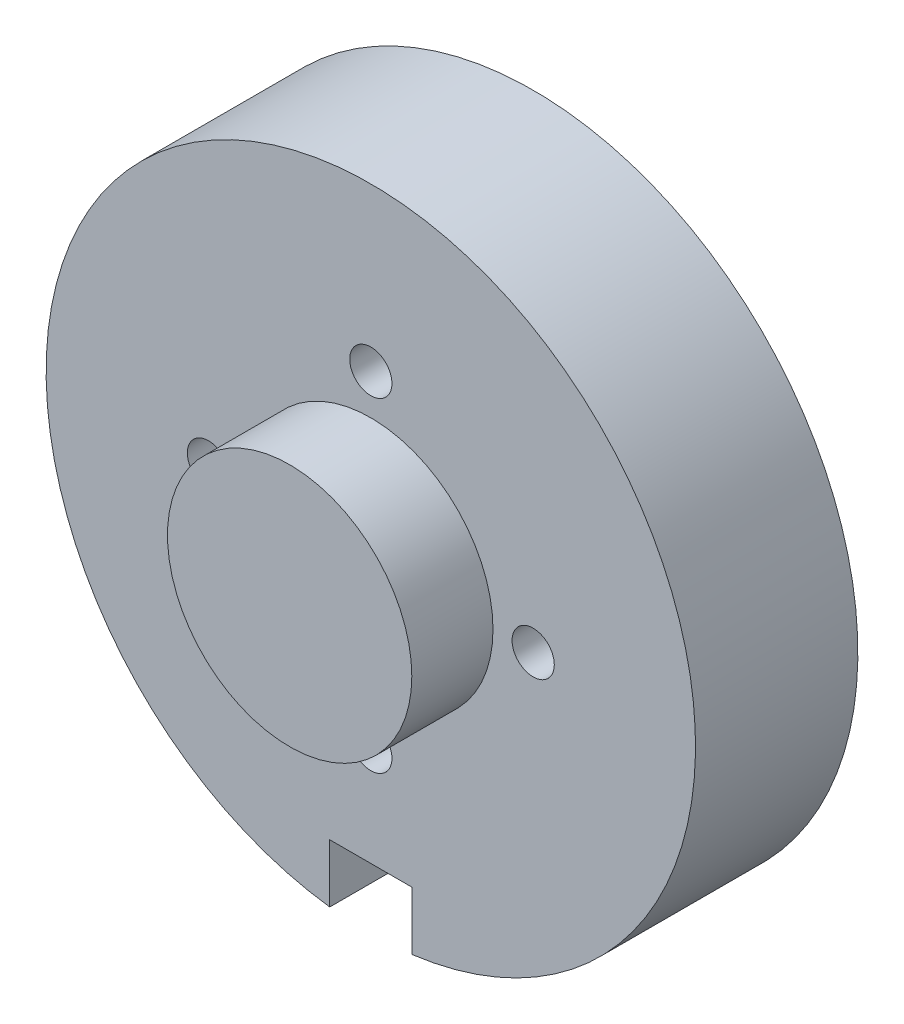
ISO-10303-21;
HEADER;
FILE_DESCRIPTION(('STEP AP214'),'2;1');
FILE_NAME('part.step','',(''),(''),'','','');
FILE_SCHEMA(('AUTOMOTIVE_DESIGN { 1 0 10303 214 1 1 1 1 }'));
ENDSEC;
DATA;
#1=APPLICATION_CONTEXT('core data for automotive mechanical design processes');
#2=APPLICATION_PROTOCOL_DEFINITION('international standard','automotive_design',2000,#1);
#3=PRODUCT_CONTEXT('',#1,'mechanical');
#4=PRODUCT('Part','Part','',(#3));
#5=PRODUCT_RELATED_PRODUCT_CATEGORY('part','',(#4));
#6=PRODUCT_DEFINITION_FORMATION('','',#4);
#7=PRODUCT_DEFINITION_CONTEXT('part definition',#1,'design');
#8=PRODUCT_DEFINITION('design','',#6,#7);
#9=PRODUCT_DEFINITION_SHAPE('','',#8);
#10=(LENGTH_UNIT() NAMED_UNIT(*) SI_UNIT(.MILLI.,.METRE.));
#11=(NAMED_UNIT(*) PLANE_ANGLE_UNIT() SI_UNIT($,.RADIAN.));
#12=(NAMED_UNIT(*) SI_UNIT($,.STERADIAN.) SOLID_ANGLE_UNIT());
#13=UNCERTAINTY_MEASURE_WITH_UNIT(LENGTH_MEASURE(1.E-05),#10,'distance_accuracy_value','');
#14=(GEOMETRIC_REPRESENTATION_CONTEXT(3) GLOBAL_UNCERTAINTY_ASSIGNED_CONTEXT((#13)) GLOBAL_UNIT_ASSIGNED_CONTEXT((#10,
#11,#12)) REPRESENTATION_CONTEXT('',''));
#15=CARTESIAN_POINT('',(0.,0.,0.));
#16=DIRECTION('',(0.,0.,1.));
#17=DIRECTION('',(1.,0.,0.));
#18=AXIS2_PLACEMENT_3D('',#15,#16,#17);
#19=CARTESIAN_POINT('',(6.42620000000001,0.,-25.4));
#20=DIRECTION('',(-1.,0.,0.));
#21=DIRECTION('',(0.,-1.,0.));
#22=AXIS2_PLACEMENT_3D('',#19,#20,#21);
#23=PLANE('',#22);
#24=DIRECTION('',(0.,-1.,0.));
#25=VECTOR('',#24,1.);
#26=CARTESIAN_POINT('',(6.42620000000001,0.,0.));
#27=LINE('',#26,#25);
#28=CARTESIAN_POINT('',(6.4262,-41.275,0.));
#29=VERTEX_POINT('',#28);
#30=CARTESIAN_POINT('',(6.4262,-50.3919036508842,0.));
#31=VERTEX_POINT('',#30);
#32=EDGE_CURVE('E128',#29,#31,#27,.T.);
#33=ORIENTED_EDGE('',*,*,#32,.F.);
#34=DIRECTION('',(0.,0.,1.));
#35=VECTOR('',#34,1.);
#36=CARTESIAN_POINT('',(6.4262,-41.275,-25.4));
#37=LINE('',#36,#35);
#38=CARTESIAN_POINT('',(6.4262,-41.275,-25.4));
#39=VERTEX_POINT('',#38);
#40=EDGE_CURVE('E11',#39,#29,#37,.T.);
#41=ORIENTED_EDGE('',*,*,#40,.F.);
#42=DIRECTION('',(0.,-1.,0.));
#43=VECTOR('',#42,1.);
#44=CARTESIAN_POINT('',(6.42620000000001,0.,-25.4));
#45=LINE('',#44,#43);
#46=CARTESIAN_POINT('',(6.4262,-50.3919036508842,-25.4));
#47=VERTEX_POINT('',#46);
#48=EDGE_CURVE('E102',#39,#47,#45,.T.);
#49=ORIENTED_EDGE('',*,*,#48,.T.);
#50=DIRECTION('',(0.,0.,1.));
#51=VECTOR('',#50,1.);
#52=CARTESIAN_POINT('',(6.4262,-50.3919036508842,-25.4));
#53=LINE('',#52,#51);
#54=EDGE_CURVE('E43',#47,#31,#53,.T.);
#55=ORIENTED_EDGE('',*,*,#54,.T.);
#56=EDGE_LOOP('',(#33,#41,#49,#55));
#57=FACE_BOUND('',#56,.T.);
#58=ADVANCED_FACE('F39',(#57),#23,.T.);
#59=CARTESIAN_POINT('',(0.,-41.275,-25.4));
#60=DIRECTION('',(0.,-1.,0.));
#61=DIRECTION('',(0.,0.,-1.));
#62=AXIS2_PLACEMENT_3D('',#59,#60,#61);
#63=PLANE('',#62);
#64=DIRECTION('',(1.,0.,0.));
#65=VECTOR('',#64,1.);
#66=CARTESIAN_POINT('',(0.,-41.275,0.));
#67=LINE('',#66,#65);
#68=CARTESIAN_POINT('',(-6.4262,-41.275,0.));
#69=VERTEX_POINT('',#68);
#70=EDGE_CURVE('E137',#69,#29,#67,.T.);
#71=ORIENTED_EDGE('',*,*,#70,.F.);
#72=DIRECTION('',(0.,0.,1.));
#73=VECTOR('',#72,1.);
#74=CARTESIAN_POINT('',(-6.4262,-41.275,-25.4));
#75=LINE('',#74,#73);
#76=CARTESIAN_POINT('',(-6.4262,-41.275,-25.4));
#77=VERTEX_POINT('',#76);
#78=EDGE_CURVE('E50',#77,#69,#75,.T.);
#79=ORIENTED_EDGE('',*,*,#78,.F.);
#80=DIRECTION('',(1.,0.,0.));
#81=VECTOR('',#80,1.);
#82=CARTESIAN_POINT('',(0.,-41.275,-25.4));
#83=LINE('',#82,#81);
#84=EDGE_CURVE('E92',#77,#39,#83,.T.);
#85=ORIENTED_EDGE('',*,*,#84,.T.);
#86=ORIENTED_EDGE('',*,*,#40,.T.);
#87=EDGE_LOOP('',(#71,#79,#85,#86));
#88=FACE_BOUND('',#87,.T.);
#89=ADVANCED_FACE('F146',(#88),#63,.T.);
#90=CARTESIAN_POINT('',(-6.42620000000001,0.,-25.4));
#91=DIRECTION('',(-1.,0.,0.));
#92=DIRECTION('',(0.,-1.,0.));
#93=AXIS2_PLACEMENT_3D('',#90,#91,#92);
#94=PLANE('',#93);
#95=DIRECTION('',(0.,-1.,0.));
#96=VECTOR('',#95,1.);
#97=CARTESIAN_POINT('',(-6.42620000000001,0.,0.));
#98=LINE('',#97,#96);
#99=CARTESIAN_POINT('',(-6.4262,-50.3919036508842,0.));
#100=VERTEX_POINT('',#99);
#101=EDGE_CURVE('E97',#69,#100,#98,.T.);
#102=ORIENTED_EDGE('',*,*,#101,.T.);
#103=DIRECTION('',(0.,0.,1.));
#104=VECTOR('',#103,1.);
#105=CARTESIAN_POINT('',(-6.4262,-50.3919036508842,-25.4));
#106=LINE('',#105,#104);
#107=CARTESIAN_POINT('',(-6.4262,-50.3919036508842,-25.4));
#108=VERTEX_POINT('',#107);
#109=EDGE_CURVE('E95',#108,#100,#106,.T.);
#110=ORIENTED_EDGE('',*,*,#109,.F.);
#111=DIRECTION('',(0.,-1.,0.));
#112=VECTOR('',#111,1.);
#113=CARTESIAN_POINT('',(-6.42620000000001,0.,-25.4));
#114=LINE('',#113,#112);
#115=EDGE_CURVE('E88',#77,#108,#114,.T.);
#116=ORIENTED_EDGE('',*,*,#115,.F.);
#117=ORIENTED_EDGE('',*,*,#78,.T.);
#118=EDGE_LOOP('',(#102,#110,#116,#117));
#119=FACE_BOUND('',#118,.T.);
#120=ADVANCED_FACE('F96',(#119),#94,.F.);
#121=CARTESIAN_POINT('',(0.,25.4,-25.4));
#122=DIRECTION('',(0.,0.,1.));
#123=DIRECTION('',(1.,0.,0.));
#124=AXIS2_PLACEMENT_3D('',#121,#122,#123);
#125=CYLINDRICAL_SURFACE('',#124,3.302);
#126=CARTESIAN_POINT('',(0.,25.4,-25.4));
#127=DIRECTION('',(0.,0.,1.));
#128=DIRECTION('',(1.,0.,0.));
#129=AXIS2_PLACEMENT_3D('',#126,#127,#128);
#130=CIRCLE('',#129,3.302);
#131=CARTESIAN_POINT('',(3.302,25.4,-25.4));
#132=VERTEX_POINT('',#131);
#133=EDGE_CURVE('E105',#132,#132,#130,.T.);
#134=ORIENTED_EDGE('',*,*,#133,.F.);
#135=EDGE_LOOP('',(#134));
#136=FACE_BOUND('',#135,.T.);
#137=CARTESIAN_POINT('',(0.,25.4,0.));
#138=DIRECTION('',(0.,0.,1.));
#139=DIRECTION('',(1.,0.,0.));
#140=AXIS2_PLACEMENT_3D('',#137,#138,#139);
#141=CIRCLE('',#140,3.302);
#142=CARTESIAN_POINT('',(3.302,25.4,0.));
#143=VERTEX_POINT('',#142);
#144=EDGE_CURVE('E124',#143,#143,#141,.T.);
#145=ORIENTED_EDGE('',*,*,#144,.T.);
#146=EDGE_LOOP('',(#145));
#147=FACE_BOUND('',#146,.T.);
#148=ADVANCED_FACE('F153',(#136,#147),#125,.F.);
#149=CARTESIAN_POINT('',(25.4,0.,-25.4));
#150=DIRECTION('',(0.,0.,1.));
#151=DIRECTION('',(1.,0.,0.));
#152=AXIS2_PLACEMENT_3D('',#149,#150,#151);
#153=CYLINDRICAL_SURFACE('',#152,3.302);
#154=CARTESIAN_POINT('',(25.4,0.,-25.4));
#155=DIRECTION('',(0.,0.,1.));
#156=DIRECTION('',(1.,0.,0.));
#157=AXIS2_PLACEMENT_3D('',#154,#155,#156);
#158=CIRCLE('',#157,3.302);
#159=CARTESIAN_POINT('',(28.702,0.,-25.4));
#160=VERTEX_POINT('',#159);
#161=EDGE_CURVE('E215',#160,#160,#158,.T.);
#162=ORIENTED_EDGE('',*,*,#161,.F.);
#163=EDGE_LOOP('',(#162));
#164=FACE_BOUND('',#163,.T.);
#165=CARTESIAN_POINT('',(25.4,0.,0.));
#166=DIRECTION('',(0.,0.,1.));
#167=DIRECTION('',(1.,0.,0.));
#168=AXIS2_PLACEMENT_3D('',#165,#166,#167);
#169=CIRCLE('',#168,3.302);
#170=CARTESIAN_POINT('',(28.702,0.,0.));
#171=VERTEX_POINT('',#170);
#172=EDGE_CURVE('E120',#171,#171,#169,.T.);
#173=ORIENTED_EDGE('',*,*,#172,.T.);
#174=EDGE_LOOP('',(#173));
#175=FACE_BOUND('',#174,.T.);
#176=ADVANCED_FACE('F163',(#164,#175),#153,.F.);
#177=CARTESIAN_POINT('',(0.,-25.4,-25.4));
#178=DIRECTION('',(0.,0.,1.));
#179=DIRECTION('',(1.,0.,0.));
#180=AXIS2_PLACEMENT_3D('',#177,#178,#179);
#181=CYLINDRICAL_SURFACE('',#180,3.30200000000137);
#182=CARTESIAN_POINT('',(0.,-25.4,-25.4));
#183=DIRECTION('',(0.,0.,1.));
#184=DIRECTION('',(1.,0.,0.));
#185=AXIS2_PLACEMENT_3D('',#182,#183,#184);
#186=CIRCLE('',#185,3.30200000000137);
#187=CARTESIAN_POINT('',(3.30200000000138,-25.4,-25.4));
#188=VERTEX_POINT('',#187);
#189=EDGE_CURVE('E177',#188,#188,#186,.T.);
#190=ORIENTED_EDGE('',*,*,#189,.F.);
#191=EDGE_LOOP('',(#190));
#192=FACE_BOUND('',#191,.T.);
#193=CARTESIAN_POINT('',(0.,-25.4,0.));
#194=DIRECTION('',(0.,0.,1.));
#195=DIRECTION('',(1.,0.,0.));
#196=AXIS2_PLACEMENT_3D('',#193,#194,#195);
#197=CIRCLE('',#196,3.30200000000137);
#198=CARTESIAN_POINT('',(3.30200000000138,-25.4,0.));
#199=VERTEX_POINT('',#198);
#200=EDGE_CURVE('E115',#199,#199,#197,.T.);
#201=ORIENTED_EDGE('',*,*,#200,.T.);
#202=EDGE_LOOP('',(#201));
#203=FACE_BOUND('',#202,.T.);
#204=ADVANCED_FACE('F166',(#192,#203),#181,.F.);
#205=CARTESIAN_POINT('',(-25.3999999999993,-7.20343923399369E-13,-25.4));
#206=DIRECTION('',(0.,0.,1.));
#207=DIRECTION('',(1.,0.,0.));
#208=AXIS2_PLACEMENT_3D('',#205,#206,#207);
#209=CYLINDRICAL_SURFACE('',#208,3.302);
#210=CARTESIAN_POINT('',(-25.3999999999993,-7.20343923399369E-13,-25.4));
#211=DIRECTION('',(0.,0.,1.));
#212=DIRECTION('',(1.,0.,0.));
#213=AXIS2_PLACEMENT_3D('',#210,#211,#212);
#214=CIRCLE('',#213,3.302);
#215=CARTESIAN_POINT('',(-22.0979999999993,-7.20343923399369E-13,-25.4));
#216=VERTEX_POINT('',#215);
#217=EDGE_CURVE('E140',#216,#216,#214,.T.);
#218=ORIENTED_EDGE('',*,*,#217,.F.);
#219=EDGE_LOOP('',(#218));
#220=FACE_BOUND('',#219,.T.);
#221=CARTESIAN_POINT('',(-25.3999999999993,-7.20343923399369E-13,0.));
#222=DIRECTION('',(0.,0.,1.));
#223=DIRECTION('',(1.,0.,0.));
#224=AXIS2_PLACEMENT_3D('',#221,#222,#223);
#225=CIRCLE('',#224,3.302);
#226=CARTESIAN_POINT('',(-22.0979999999993,-7.20343923399369E-13,0.));
#227=VERTEX_POINT('',#226);
#228=EDGE_CURVE('E111',#227,#227,#225,.T.);
#229=ORIENTED_EDGE('',*,*,#228,.T.);
#230=EDGE_LOOP('',(#229));
#231=FACE_BOUND('',#230,.T.);
#232=ADVANCED_FACE('F41',(#220,#231),#209,.F.);
#233=CARTESIAN_POINT('',(0.,0.,-25.4));
#234=DIRECTION('',(0.,0.,1.));
#235=DIRECTION('',(1.,0.,0.));
#236=AXIS2_PLACEMENT_3D('',#233,#234,#235);
#237=CYLINDRICAL_SURFACE('',#236,50.8);
#238=CARTESIAN_POINT('',(0.,0.,0.));
#239=DIRECTION('',(0.,0.,1.));
#240=DIRECTION('',(1.,0.,0.));
#241=AXIS2_PLACEMENT_3D('',#238,#239,#240);
#242=CIRCLE('',#241,50.8);
#243=EDGE_CURVE('E132',#31,#100,#242,.T.);
#244=ORIENTED_EDGE('',*,*,#243,.F.);
#245=ORIENTED_EDGE('',*,*,#54,.F.);
#246=CARTESIAN_POINT('',(0.,0.,-25.4));
#247=DIRECTION('',(0.,0.,1.));
#248=DIRECTION('',(1.,0.,0.));
#249=AXIS2_PLACEMENT_3D('',#246,#247,#248);
#250=CIRCLE('',#249,50.8);
#251=EDGE_CURVE('E91',#47,#108,#250,.T.);
#252=ORIENTED_EDGE('',*,*,#251,.T.);
#253=ORIENTED_EDGE('',*,*,#109,.T.);
#254=EDGE_LOOP('',(#244,#245,#252,#253));
#255=FACE_BOUND('',#254,.T.);
#256=ADVANCED_FACE('F100',(#255),#237,.T.);
#257=CARTESIAN_POINT('',(0.,0.,-25.4));
#258=DIRECTION('',(0.,0.,1.));
#259=DIRECTION('',(1.,0.,0.));
#260=AXIS2_PLACEMENT_3D('',#257,#258,#259);
#261=PLANE('',#260);
#262=ORIENTED_EDGE('',*,*,#217,.T.);
#263=EDGE_LOOP('',(#262));
#264=FACE_BOUND('',#263,.T.);
#265=ORIENTED_EDGE('',*,*,#189,.T.);
#266=EDGE_LOOP('',(#265));
#267=FACE_BOUND('',#266,.T.);
#268=ORIENTED_EDGE('',*,*,#161,.T.);
#269=EDGE_LOOP('',(#268));
#270=FACE_BOUND('',#269,.T.);
#271=ORIENTED_EDGE('',*,*,#133,.T.);
#272=EDGE_LOOP('',(#271));
#273=FACE_BOUND('',#272,.T.);
#274=ORIENTED_EDGE('',*,*,#48,.F.);
#275=ORIENTED_EDGE('',*,*,#84,.F.);
#276=ORIENTED_EDGE('',*,*,#115,.T.);
#277=ORIENTED_EDGE('',*,*,#251,.F.);
#278=EDGE_LOOP('',(#274,#275,#276,#277));
#279=FACE_BOUND('',#278,.T.);
#280=ADVANCED_FACE('F90',(#264,#267,#270,#273,#279),#261,.F.);
#281=CARTESIAN_POINT('',(0.,0.,0.));
#282=DIRECTION('',(0.,0.,1.));
#283=DIRECTION('',(1.,0.,0.));
#284=AXIS2_PLACEMENT_3D('',#281,#282,#283);
#285=PLANE('',#284);
#286=CARTESIAN_POINT('',(0.,0.,0.));
#287=DIRECTION('',(0.,0.,1.));
#288=DIRECTION('',(1.,0.,0.));
#289=AXIS2_PLACEMENT_3D('',#286,#287,#288);
#290=CIRCLE('',#289,19.1135);
#291=CARTESIAN_POINT('',(19.1135,0.,0.));
#292=VERTEX_POINT('',#291);
#293=EDGE_CURVE('E200',#292,#292,#290,.T.);
#294=ORIENTED_EDGE('',*,*,#293,.F.);
#295=EDGE_LOOP('',(#294));
#296=FACE_BOUND('',#295,.T.);
#297=ORIENTED_EDGE('',*,*,#228,.F.);
#298=EDGE_LOOP('',(#297));
#299=FACE_BOUND('',#298,.T.);
#300=ORIENTED_EDGE('',*,*,#200,.F.);
#301=EDGE_LOOP('',(#300));
#302=FACE_BOUND('',#301,.T.);
#303=ORIENTED_EDGE('',*,*,#172,.F.);
#304=EDGE_LOOP('',(#303));
#305=FACE_BOUND('',#304,.T.);
#306=ORIENTED_EDGE('',*,*,#144,.F.);
#307=EDGE_LOOP('',(#306));
#308=FACE_BOUND('',#307,.T.);
#309=ORIENTED_EDGE('',*,*,#32,.T.);
#310=ORIENTED_EDGE('',*,*,#243,.T.);
#311=ORIENTED_EDGE('',*,*,#101,.F.);
#312=ORIENTED_EDGE('',*,*,#70,.T.);
#313=EDGE_LOOP('',(#309,#310,#311,#312));
#314=FACE_BOUND('',#313,.T.);
#315=ADVANCED_FACE('F145',(#296,#299,#302,#305,#308,#314),#285,.T.);
#316=CARTESIAN_POINT('',(0.,0.,12.7));
#317=DIRECTION('',(0.,0.,-1.));
#318=DIRECTION('',(-1.,0.,0.));
#319=AXIS2_PLACEMENT_3D('',#316,#317,#318);
#320=CYLINDRICAL_SURFACE('',#319,19.1135);
#321=CARTESIAN_POINT('',(0.,0.,12.7));
#322=DIRECTION('',(0.,0.,1.));
#323=DIRECTION('',(1.,0.,0.));
#324=AXIS2_PLACEMENT_3D('',#321,#322,#323);
#325=CIRCLE('',#324,19.1135);
#326=CARTESIAN_POINT('',(19.1135,0.,12.7));
#327=VERTEX_POINT('',#326);
#328=EDGE_CURVE('E116',#327,#327,#325,.T.);
#329=ORIENTED_EDGE('',*,*,#328,.F.);
#330=EDGE_LOOP('',(#329));
#331=FACE_BOUND('',#330,.T.);
#332=ORIENTED_EDGE('',*,*,#293,.T.);
#333=EDGE_LOOP('',(#332));
#334=FACE_BOUND('',#333,.T.);
#335=ADVANCED_FACE('F182',(#331,#334),#320,.T.);
#336=CARTESIAN_POINT('',(0.,0.,12.7));
#337=DIRECTION('',(0.,0.,1.));
#338=DIRECTION('',(1.,0.,0.));
#339=AXIS2_PLACEMENT_3D('',#336,#337,#338);
#340=PLANE('',#339);
#341=ORIENTED_EDGE('',*,*,#328,.T.);
#342=EDGE_LOOP('',(#341));
#343=FACE_BOUND('',#342,.T.);
#344=ADVANCED_FACE('F193',(#343),#340,.T.);
#345=CLOSED_SHELL('',(#58,#89,#120,#148,#176,#204,#232,#256,#280,#315,#335,#344));
#346=MANIFOLD_SOLID_BREP('B2',#345);
#347=ADVANCED_BREP_SHAPE_REPRESENTATION('',(#18,#346),#14);
#348=SHAPE_DEFINITION_REPRESENTATION(#9,#347);
ENDSEC;
END-ISO-10303-21;
